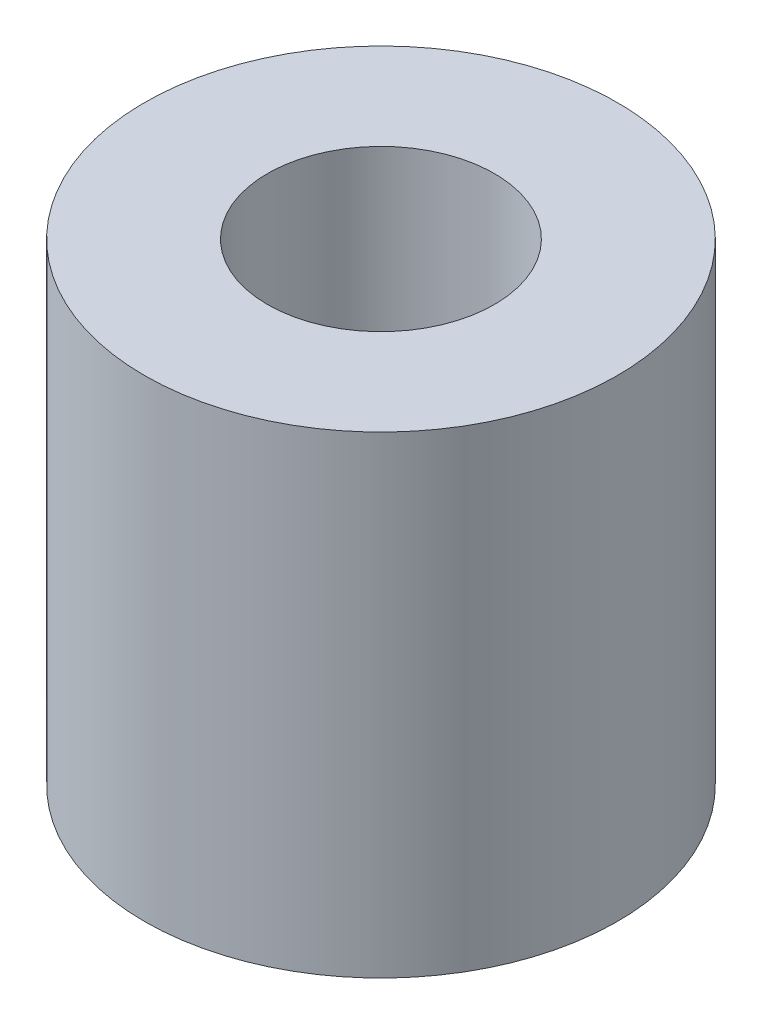
ISO-10303-21;
HEADER;
FILE_DESCRIPTION(('STEP AP214'),'2;1');
FILE_NAME('part.step','',(''),(''),'','','');
FILE_SCHEMA(('AUTOMOTIVE_DESIGN { 1 0 10303 214 1 1 1 1 }'));
ENDSEC;
DATA;
#1=APPLICATION_CONTEXT('core data for automotive mechanical design processes');
#2=APPLICATION_PROTOCOL_DEFINITION('international standard','automotive_design',2000,#1);
#3=PRODUCT_CONTEXT('',#1,'mechanical');
#4=PRODUCT('Part','Part','',(#3));
#5=PRODUCT_RELATED_PRODUCT_CATEGORY('part','',(#4));
#6=PRODUCT_DEFINITION_FORMATION('','',#4);
#7=PRODUCT_DEFINITION_CONTEXT('part definition',#1,'design');
#8=PRODUCT_DEFINITION('design','',#6,#7);
#9=PRODUCT_DEFINITION_SHAPE('','',#8);
#10=(LENGTH_UNIT() NAMED_UNIT(*) SI_UNIT(.MILLI.,.METRE.));
#11=(NAMED_UNIT(*) PLANE_ANGLE_UNIT() SI_UNIT($,.RADIAN.));
#12=(NAMED_UNIT(*) SI_UNIT($,.STERADIAN.) SOLID_ANGLE_UNIT());
#13=UNCERTAINTY_MEASURE_WITH_UNIT(LENGTH_MEASURE(1.E-05),#10,'distance_accuracy_value','');
#14=(GEOMETRIC_REPRESENTATION_CONTEXT(3) GLOBAL_UNCERTAINTY_ASSIGNED_CONTEXT((#13)) GLOBAL_UNIT_ASSIGNED_CONTEXT((#10,
#11,#12)) REPRESENTATION_CONTEXT('',''));
#15=CARTESIAN_POINT('',(0.,0.,0.));
#16=DIRECTION('',(0.,0.,1.));
#17=DIRECTION('',(1.,0.,0.));
#18=AXIS2_PLACEMENT_3D('',#15,#16,#17);
#19=CARTESIAN_POINT('',(0.,6.35,0.));
#20=DIRECTION('',(0.,1.,0.));
#21=DIRECTION('',(0.,0.,1.));
#22=AXIS2_PLACEMENT_3D('',#19,#20,#21);
#23=PLANE('',#22);
#24=CARTESIAN_POINT('',(0.,6.35,0.));
#25=DIRECTION('',(0.,1.,0.));
#26=DIRECTION('',(0.,0.,1.));
#27=AXIS2_PLACEMENT_3D('',#24,#25,#26);
#28=CIRCLE('',#27,3.175);
#29=CARTESIAN_POINT('',(0.,6.35,3.175));
#30=VERTEX_POINT('',#29);
#31=EDGE_CURVE('E10',#30,#30,#28,.T.);
#32=ORIENTED_EDGE('',*,*,#31,.T.);
#33=EDGE_LOOP('',(#32));
#34=FACE_BOUND('',#33,.T.);
#35=CARTESIAN_POINT('',(0.,6.35,0.));
#36=DIRECTION('',(0.,1.,0.));
#37=DIRECTION('',(0.,0.,1.));
#38=AXIS2_PLACEMENT_3D('',#35,#36,#37);
#39=CIRCLE('',#38,1.524);
#40=CARTESIAN_POINT('',(0.,6.35,1.524));
#41=VERTEX_POINT('',#40);
#42=EDGE_CURVE('E40',#41,#41,#39,.T.);
#43=ORIENTED_EDGE('',*,*,#42,.F.);
#44=EDGE_LOOP('',(#43));
#45=FACE_BOUND('',#44,.T.);
#46=ADVANCED_FACE('F29',(#34,#45),#23,.T.);
#47=CARTESIAN_POINT('',(0.,0.,0.));
#48=DIRECTION('',(0.,1.,0.));
#49=DIRECTION('',(0.,0.,1.));
#50=AXIS2_PLACEMENT_3D('',#47,#48,#49);
#51=PLANE('',#50);
#52=CARTESIAN_POINT('',(0.,0.,0.));
#53=DIRECTION('',(0.,1.,0.));
#54=DIRECTION('',(0.,0.,1.));
#55=AXIS2_PLACEMENT_3D('',#52,#53,#54);
#56=CIRCLE('',#55,3.175);
#57=CARTESIAN_POINT('',(0.,0.,3.175));
#58=VERTEX_POINT('',#57);
#59=EDGE_CURVE('E33',#58,#58,#56,.T.);
#60=ORIENTED_EDGE('',*,*,#59,.F.);
#61=EDGE_LOOP('',(#60));
#62=FACE_BOUND('',#61,.T.);
#63=CARTESIAN_POINT('',(0.,0.,0.));
#64=DIRECTION('',(0.,1.,0.));
#65=DIRECTION('',(0.,0.,1.));
#66=AXIS2_PLACEMENT_3D('',#63,#64,#65);
#67=CIRCLE('',#66,1.524);
#68=CARTESIAN_POINT('',(0.,0.,1.524));
#69=VERTEX_POINT('',#68);
#70=EDGE_CURVE('E42',#69,#69,#67,.T.);
#71=ORIENTED_EDGE('',*,*,#70,.T.);
#72=EDGE_LOOP('',(#71));
#73=FACE_BOUND('',#72,.T.);
#74=ADVANCED_FACE('F52',(#62,#73),#51,.F.);
#75=CARTESIAN_POINT('',(0.,6.35,0.));
#76=DIRECTION('',(0.,-1.,0.));
#77=DIRECTION('',(0.,0.,-1.));
#78=AXIS2_PLACEMENT_3D('',#75,#76,#77);
#79=CYLINDRICAL_SURFACE('',#78,3.175);
#80=ORIENTED_EDGE('',*,*,#31,.F.);
#81=EDGE_LOOP('',(#80));
#82=FACE_BOUND('',#81,.T.);
#83=ORIENTED_EDGE('',*,*,#59,.T.);
#84=EDGE_LOOP('',(#83));
#85=FACE_BOUND('',#84,.T.);
#86=ADVANCED_FACE('F31',(#82,#85),#79,.T.);
#87=CARTESIAN_POINT('',(0.,6.35,0.));
#88=DIRECTION('',(0.,-1.,0.));
#89=DIRECTION('',(0.,0.,-1.));
#90=AXIS2_PLACEMENT_3D('',#87,#88,#89);
#91=CYLINDRICAL_SURFACE('',#90,1.524);
#92=ORIENTED_EDGE('',*,*,#42,.T.);
#93=EDGE_LOOP('',(#92));
#94=FACE_BOUND('',#93,.T.);
#95=ORIENTED_EDGE('',*,*,#70,.F.);
#96=EDGE_LOOP('',(#95));
#97=FACE_BOUND('',#96,.T.);
#98=ADVANCED_FACE('F48',(#94,#97),#91,.F.);
#99=CLOSED_SHELL('',(#46,#74,#86,#98));
#100=MANIFOLD_SOLID_BREP('B2',#99);
#101=ADVANCED_BREP_SHAPE_REPRESENTATION('',(#18,#100),#14);
#102=SHAPE_DEFINITION_REPRESENTATION(#9,#101);
ENDSEC;
END-ISO-10303-21;
